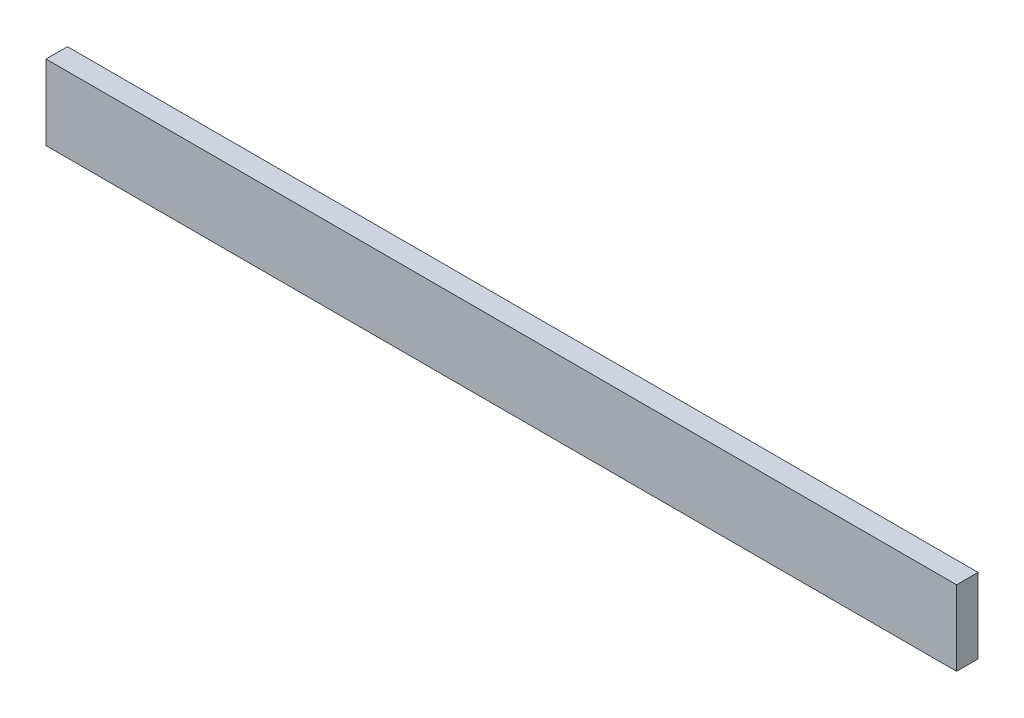
ISO-10303-21;
HEADER;
FILE_DESCRIPTION(('STEP AP214'),'2;1');
FILE_NAME('part.step','',(''),(''),'','','');
FILE_SCHEMA(('AUTOMOTIVE_DESIGN { 1 0 10303 214 1 1 1 1 }'));
ENDSEC;
DATA;
#1=APPLICATION_CONTEXT('core data for automotive mechanical design processes');
#2=APPLICATION_PROTOCOL_DEFINITION('international standard','automotive_design',2000,#1);
#3=PRODUCT_CONTEXT('',#1,'mechanical');
#4=PRODUCT('Part','Part','',(#3));
#5=PRODUCT_RELATED_PRODUCT_CATEGORY('part','',(#4));
#6=PRODUCT_DEFINITION_FORMATION('','',#4);
#7=PRODUCT_DEFINITION_CONTEXT('part definition',#1,'design');
#8=PRODUCT_DEFINITION('design','',#6,#7);
#9=PRODUCT_DEFINITION_SHAPE('','',#8);
#10=(LENGTH_UNIT() NAMED_UNIT(*) SI_UNIT(.MILLI.,.METRE.));
#11=(NAMED_UNIT(*) PLANE_ANGLE_UNIT() SI_UNIT($,.RADIAN.));
#12=(NAMED_UNIT(*) SI_UNIT($,.STERADIAN.) SOLID_ANGLE_UNIT());
#13=UNCERTAINTY_MEASURE_WITH_UNIT(LENGTH_MEASURE(1.E-05),#10,'distance_accuracy_value','');
#14=(GEOMETRIC_REPRESENTATION_CONTEXT(3) GLOBAL_UNCERTAINTY_ASSIGNED_CONTEXT((#13)) GLOBAL_UNIT_ASSIGNED_CONTEXT((#10,
#11,#12)) REPRESENTATION_CONTEXT('',''));
#15=CARTESIAN_POINT('',(0.,0.,0.));
#16=DIRECTION('',(0.,0.,1.));
#17=DIRECTION('',(1.,0.,0.));
#18=AXIS2_PLACEMENT_3D('',#15,#16,#17);
#19=CARTESIAN_POINT('',(0.,0.,2.));
#20=DIRECTION('',(1.,0.,0.));
#21=DIRECTION('',(0.,0.,-1.));
#22=AXIS2_PLACEMENT_3D('',#19,#20,#21);
#23=PLANE('',#22);
#24=DIRECTION('',(0.,-1.,0.));
#25=VECTOR('',#24,1.);
#26=CARTESIAN_POINT('',(0.,0.,0.));
#27=LINE('',#26,#25);
#28=CARTESIAN_POINT('',(0.,7.,0.));
#29=VERTEX_POINT('',#28);
#30=CARTESIAN_POINT('',(0.,0.,0.));
#31=VERTEX_POINT('',#30);
#32=EDGE_CURVE('E95',#29,#31,#27,.T.);
#33=ORIENTED_EDGE('',*,*,#32,.T.);
#34=DIRECTION('',(0.,0.,-1.));
#35=VECTOR('',#34,1.);
#36=CARTESIAN_POINT('',(0.,0.,2.));
#37=LINE('',#36,#35);
#38=CARTESIAN_POINT('',(0.,0.,2.));
#39=VERTEX_POINT('',#38);
#40=EDGE_CURVE('E11',#39,#31,#37,.T.);
#41=ORIENTED_EDGE('',*,*,#40,.F.);
#42=DIRECTION('',(0.,-1.,0.));
#43=VECTOR('',#42,1.);
#44=CARTESIAN_POINT('',(0.,0.,2.));
#45=LINE('',#44,#43);
#46=CARTESIAN_POINT('',(0.,7.,2.));
#47=VERTEX_POINT('',#46);
#48=EDGE_CURVE('E83',#47,#39,#45,.T.);
#49=ORIENTED_EDGE('',*,*,#48,.F.);
#50=DIRECTION('',(0.,0.,-1.));
#51=VECTOR('',#50,1.);
#52=CARTESIAN_POINT('',(0.,7.,2.));
#53=LINE('',#52,#51);
#54=EDGE_CURVE('E91',#47,#29,#53,.T.);
#55=ORIENTED_EDGE('',*,*,#54,.T.);
#56=EDGE_LOOP('',(#33,#41,#49,#55));
#57=FACE_BOUND('',#56,.T.);
#58=ADVANCED_FACE('F32',(#57),#23,.F.);
#59=CARTESIAN_POINT('',(0.,0.,2.));
#60=DIRECTION('',(0.,1.,0.));
#61=DIRECTION('',(0.,0.,1.));
#62=AXIS2_PLACEMENT_3D('',#59,#60,#61);
#63=PLANE('',#62);
#64=DIRECTION('',(1.,0.,0.));
#65=VECTOR('',#64,1.);
#66=CARTESIAN_POINT('',(0.,0.,0.));
#67=LINE('',#66,#65);
#68=CARTESIAN_POINT('',(85.,0.,0.));
#69=VERTEX_POINT('',#68);
#70=EDGE_CURVE('E87',#31,#69,#67,.T.);
#71=ORIENTED_EDGE('',*,*,#70,.T.);
#72=DIRECTION('',(0.,0.,-1.));
#73=VECTOR('',#72,1.);
#74=CARTESIAN_POINT('',(85.,0.,2.));
#75=LINE('',#74,#73);
#76=CARTESIAN_POINT('',(85.,0.,2.));
#77=VERTEX_POINT('',#76);
#78=EDGE_CURVE('E40',#77,#69,#75,.T.);
#79=ORIENTED_EDGE('',*,*,#78,.F.);
#80=DIRECTION('',(1.,0.,0.));
#81=VECTOR('',#80,1.);
#82=CARTESIAN_POINT('',(0.,0.,2.));
#83=LINE('',#82,#81);
#84=EDGE_CURVE('E78',#39,#77,#83,.T.);
#85=ORIENTED_EDGE('',*,*,#84,.F.);
#86=ORIENTED_EDGE('',*,*,#40,.T.);
#87=EDGE_LOOP('',(#71,#79,#85,#86));
#88=FACE_BOUND('',#87,.T.);
#89=ADVANCED_FACE('F86',(#88),#63,.F.);
#90=CARTESIAN_POINT('',(85.,0.,2.));
#91=DIRECTION('',(-1.,0.,0.));
#92=DIRECTION('',(0.,0.,1.));
#93=AXIS2_PLACEMENT_3D('',#90,#91,#92);
#94=PLANE('',#93);
#95=DIRECTION('',(0.,1.,0.));
#96=VECTOR('',#95,1.);
#97=CARTESIAN_POINT('',(85.,0.,0.));
#98=LINE('',#97,#96);
#99=CARTESIAN_POINT('',(85.,7.,0.));
#100=VERTEX_POINT('',#99);
#101=EDGE_CURVE('E65',#69,#100,#98,.T.);
#102=ORIENTED_EDGE('',*,*,#101,.T.);
#103=DIRECTION('',(0.,0.,-1.));
#104=VECTOR('',#103,1.);
#105=CARTESIAN_POINT('',(85.,7.,2.));
#106=LINE('',#105,#104);
#107=CARTESIAN_POINT('',(85.,7.,2.));
#108=VERTEX_POINT('',#107);
#109=EDGE_CURVE('E88',#108,#100,#106,.T.);
#110=ORIENTED_EDGE('',*,*,#109,.F.);
#111=DIRECTION('',(0.,1.,0.));
#112=VECTOR('',#111,1.);
#113=CARTESIAN_POINT('',(85.,0.,2.));
#114=LINE('',#113,#112);
#115=EDGE_CURVE('E81',#77,#108,#114,.T.);
#116=ORIENTED_EDGE('',*,*,#115,.F.);
#117=ORIENTED_EDGE('',*,*,#78,.T.);
#118=EDGE_LOOP('',(#102,#110,#116,#117));
#119=FACE_BOUND('',#118,.T.);
#120=ADVANCED_FACE('F89',(#119),#94,.F.);
#121=CARTESIAN_POINT('',(0.,7.,2.));
#122=DIRECTION('',(0.,-1.,0.));
#123=DIRECTION('',(0.,0.,-1.));
#124=AXIS2_PLACEMENT_3D('',#121,#122,#123);
#125=PLANE('',#124);
#126=DIRECTION('',(-1.,0.,0.));
#127=VECTOR('',#126,1.);
#128=CARTESIAN_POINT('',(0.,7.,0.));
#129=LINE('',#128,#127);
#130=EDGE_CURVE('E71',#100,#29,#129,.T.);
#131=ORIENTED_EDGE('',*,*,#130,.T.);
#132=ORIENTED_EDGE('',*,*,#54,.F.);
#133=DIRECTION('',(-1.,0.,0.));
#134=VECTOR('',#133,1.);
#135=CARTESIAN_POINT('',(0.,7.,2.));
#136=LINE('',#135,#134);
#137=EDGE_CURVE('E48',#108,#47,#136,.T.);
#138=ORIENTED_EDGE('',*,*,#137,.F.);
#139=ORIENTED_EDGE('',*,*,#109,.T.);
#140=EDGE_LOOP('',(#131,#132,#138,#139));
#141=FACE_BOUND('',#140,.T.);
#142=ADVANCED_FACE('F102',(#141),#125,.F.);
#143=CARTESIAN_POINT('',(0.,0.,2.));
#144=DIRECTION('',(0.,0.,-1.));
#145=DIRECTION('',(-1.,0.,0.));
#146=AXIS2_PLACEMENT_3D('',#143,#144,#145);
#147=PLANE('',#146);
#148=ORIENTED_EDGE('',*,*,#48,.T.);
#149=ORIENTED_EDGE('',*,*,#84,.T.);
#150=ORIENTED_EDGE('',*,*,#115,.T.);
#151=ORIENTED_EDGE('',*,*,#137,.T.);
#152=EDGE_LOOP('',(#148,#149,#150,#151));
#153=FACE_BOUND('',#152,.T.);
#154=ADVANCED_FACE('F79',(#153),#147,.F.);
#155=CARTESIAN_POINT('',(0.,0.,0.));
#156=DIRECTION('',(0.,0.,-1.));
#157=DIRECTION('',(-1.,0.,0.));
#158=AXIS2_PLACEMENT_3D('',#155,#156,#157);
#159=PLANE('',#158);
#160=ORIENTED_EDGE('',*,*,#32,.F.);
#161=ORIENTED_EDGE('',*,*,#130,.F.);
#162=ORIENTED_EDGE('',*,*,#101,.F.);
#163=ORIENTED_EDGE('',*,*,#70,.F.);
#164=EDGE_LOOP('',(#160,#161,#162,#163));
#165=FACE_BOUND('',#164,.T.);
#166=ADVANCED_FACE('F105',(#165),#159,.T.);
#167=CLOSED_SHELL('',(#58,#89,#120,#142,#154,#166));
#168=MANIFOLD_SOLID_BREP('B2',#167);
#169=ADVANCED_BREP_SHAPE_REPRESENTATION('',(#18,#168),#14);
#170=SHAPE_DEFINITION_REPRESENTATION(#9,#169);
ENDSEC;
END-ISO-10303-21;
